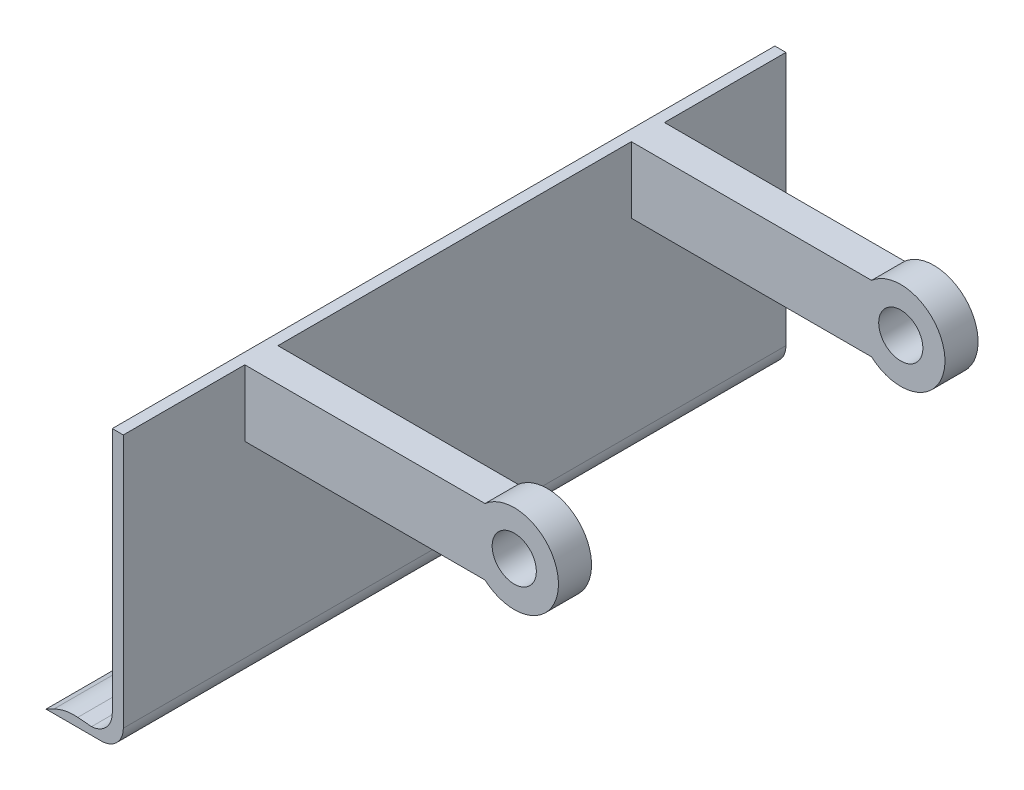
ISO-10303-21;
HEADER;
FILE_DESCRIPTION(('STEP AP214'),'2;1');
FILE_NAME('part.step','',(''),(''),'','','');
FILE_SCHEMA(('AUTOMOTIVE_DESIGN { 1 0 10303 214 1 1 1 1 }'));
ENDSEC;
DATA;
#1=APPLICATION_CONTEXT('core data for automotive mechanical design processes');
#2=APPLICATION_PROTOCOL_DEFINITION('international standard','automotive_design',2000,#1);
#3=PRODUCT_CONTEXT('',#1,'mechanical');
#4=PRODUCT('Part','Part','',(#3));
#5=PRODUCT_RELATED_PRODUCT_CATEGORY('part','',(#4));
#6=PRODUCT_DEFINITION_FORMATION('','',#4);
#7=PRODUCT_DEFINITION_CONTEXT('part definition',#1,'design');
#8=PRODUCT_DEFINITION('design','',#6,#7);
#9=PRODUCT_DEFINITION_SHAPE('','',#8);
#10=(LENGTH_UNIT() NAMED_UNIT(*) SI_UNIT(.MILLI.,.METRE.));
#11=(NAMED_UNIT(*) PLANE_ANGLE_UNIT() SI_UNIT($,.RADIAN.));
#12=(NAMED_UNIT(*) SI_UNIT($,.STERADIAN.) SOLID_ANGLE_UNIT());
#13=UNCERTAINTY_MEASURE_WITH_UNIT(LENGTH_MEASURE(1.E-05),#10,'distance_accuracy_value','');
#14=(GEOMETRIC_REPRESENTATION_CONTEXT(3) GLOBAL_UNCERTAINTY_ASSIGNED_CONTEXT((#13)) GLOBAL_UNIT_ASSIGNED_CONTEXT((#10,
#11,#12)) REPRESENTATION_CONTEXT('',''));
#15=CARTESIAN_POINT('',(0.,0.,0.));
#16=DIRECTION('',(0.,0.,1.));
#17=DIRECTION('',(1.,0.,0.));
#18=AXIS2_PLACEMENT_3D('',#15,#16,#17);
#19=CARTESIAN_POINT('',(0.,0.,300.));
#20=DIRECTION('',(-1.,0.,0.));
#21=DIRECTION('',(0.,0.,1.));
#22=AXIS2_PLACEMENT_3D('',#19,#20,#21);
#23=PLANE('',#22);
#24=DIRECTION('',(0.,-1.,0.));
#25=VECTOR('',#24,1.);
#26=CARTESIAN_POINT('',(0.,125.,70.));
#27=LINE('',#26,#25);
#28=CARTESIAN_POINT('',(0.,125.,70.));
#29=VERTEX_POINT('',#28);
#30=CARTESIAN_POINT('',(0.,95.,70.));
#31=VERTEX_POINT('',#30);
#32=EDGE_CURVE('E165',#29,#31,#27,.T.);
#33=ORIENTED_EDGE('',*,*,#32,.F.);
#34=DIRECTION('',(0.,0.,-1.));
#35=VECTOR('',#34,1.);
#36=CARTESIAN_POINT('',(0.,125.,300.));
#37=LINE('',#36,#35);
#38=CARTESIAN_POINT('',(0.,125.,230.));
#39=VERTEX_POINT('',#38);
#40=EDGE_CURVE('E248',#39,#29,#37,.T.);
#41=ORIENTED_EDGE('',*,*,#40,.F.);
#42=DIRECTION('',(0.,1.,0.));
#43=VECTOR('',#42,1.);
#44=CARTESIAN_POINT('',(0.,125.,230.));
#45=LINE('',#44,#43);
#46=CARTESIAN_POINT('',(0.,95.,230.));
#47=VERTEX_POINT('',#46);
#48=EDGE_CURVE('E161',#47,#39,#45,.T.);
#49=ORIENTED_EDGE('',*,*,#48,.F.);
#50=DIRECTION('',(0.,0.,-1.));
#51=VECTOR('',#50,1.);
#52=CARTESIAN_POINT('',(0.,95.,230.));
#53=LINE('',#52,#51);
#54=CARTESIAN_POINT('',(0.,95.,245.));
#55=VERTEX_POINT('',#54);
#56=EDGE_CURVE('E187',#55,#47,#53,.T.);
#57=ORIENTED_EDGE('',*,*,#56,.F.);
#58=DIRECTION('',(0.,-1.,0.));
#59=VECTOR('',#58,1.);
#60=CARTESIAN_POINT('',(0.,125.,245.));
#61=LINE('',#60,#59);
#62=CARTESIAN_POINT('',(0.,125.,245.));
#63=VERTEX_POINT('',#62);
#64=EDGE_CURVE('E184',#63,#55,#61,.T.);
#65=ORIENTED_EDGE('',*,*,#64,.F.);
#66=CARTESIAN_POINT('',(0.,125.,300.));
#67=VERTEX_POINT('',#66);
#68=EDGE_CURVE('E244',#67,#63,#37,.T.);
#69=ORIENTED_EDGE('',*,*,#68,.F.);
#70=DIRECTION('',(0.,1.,0.));
#71=VECTOR('',#70,1.);
#72=CARTESIAN_POINT('',(0.,0.,300.));
#73=LINE('',#72,#71);
#74=CARTESIAN_POINT('',(0.,10.0000000000001,300.));
#75=VERTEX_POINT('',#74);
#76=EDGE_CURVE('E216',#75,#67,#73,.T.);
#77=ORIENTED_EDGE('',*,*,#76,.F.);
#78=DIRECTION('',(0.,0.,-1.));
#79=VECTOR('',#78,1.);
#80=CARTESIAN_POINT('',(0.,10.0000000000001,300.));
#81=LINE('',#80,#79);
#82=CARTESIAN_POINT('',(0.,10.0000000000001,0.));
#83=VERTEX_POINT('',#82);
#84=EDGE_CURVE('E247',#75,#83,#81,.T.);
#85=ORIENTED_EDGE('',*,*,#84,.T.);
#86=DIRECTION('',(0.,1.,0.));
#87=VECTOR('',#86,1.);
#88=CARTESIAN_POINT('',(0.,0.,0.));
#89=LINE('',#88,#87);
#90=CARTESIAN_POINT('',(0.,125.,0.));
#91=VERTEX_POINT('',#90);
#92=EDGE_CURVE('E237',#83,#91,#89,.T.);
#93=ORIENTED_EDGE('',*,*,#92,.T.);
#94=CARTESIAN_POINT('',(0.,125.,55.));
#95=VERTEX_POINT('',#94);
#96=EDGE_CURVE('E243',#95,#91,#37,.T.);
#97=ORIENTED_EDGE('',*,*,#96,.F.);
#98=DIRECTION('',(0.,1.,0.));
#99=VECTOR('',#98,1.);
#100=CARTESIAN_POINT('',(0.,125.,55.));
#101=LINE('',#100,#99);
#102=CARTESIAN_POINT('',(0.,95.,55.));
#103=VERTEX_POINT('',#102);
#104=EDGE_CURVE('E173',#103,#95,#101,.T.);
#105=ORIENTED_EDGE('',*,*,#104,.F.);
#106=DIRECTION('',(0.,0.,-1.));
#107=VECTOR('',#106,1.);
#108=CARTESIAN_POINT('',(0.,95.,70.));
#109=LINE('',#108,#107);
#110=EDGE_CURVE('E156',#31,#103,#109,.T.);
#111=ORIENTED_EDGE('',*,*,#110,.F.);
#112=EDGE_LOOP('',(#33,#41,#49,#57,#65,#69,#77,#85,#93,#97,#105,#111));
#113=FACE_BOUND('',#112,.T.);
#114=ADVANCED_FACE('F35',(#113),#23,.F.);
#115=CARTESIAN_POINT('',(-5.,0.,300.));
#116=DIRECTION('',(1.,0.,0.));
#117=DIRECTION('',(0.,1.,0.));
#118=AXIS2_PLACEMENT_3D('',#115,#116,#117);
#119=PLANE('',#118);
#120=DIRECTION('',(0.,-1.,0.));
#121=VECTOR('',#120,1.);
#122=CARTESIAN_POINT('',(-5.,0.,0.));
#123=LINE('',#122,#121);
#124=CARTESIAN_POINT('',(-5.,125.,0.));
#125=VERTEX_POINT('',#124);
#126=CARTESIAN_POINT('',(-5.,13.4179912743919,0.));
#127=VERTEX_POINT('',#126);
#128=EDGE_CURVE('E198',#125,#127,#123,.T.);
#129=ORIENTED_EDGE('',*,*,#128,.T.);
#130=DIRECTION('',(0.,0.,-1.));
#131=VECTOR('',#130,1.);
#132=CARTESIAN_POINT('',(-5.,13.4179912743919,300.));
#133=LINE('',#132,#131);
#134=CARTESIAN_POINT('',(-5.,13.4179912743919,300.));
#135=VERTEX_POINT('',#134);
#136=EDGE_CURVE('E44',#135,#127,#133,.T.);
#137=ORIENTED_EDGE('',*,*,#136,.F.);
#138=DIRECTION('',(0.,-1.,0.));
#139=VECTOR('',#138,1.);
#140=CARTESIAN_POINT('',(-5.,0.,300.));
#141=LINE('',#140,#139);
#142=CARTESIAN_POINT('',(-5.,125.,300.));
#143=VERTEX_POINT('',#142);
#144=EDGE_CURVE('E199',#143,#135,#141,.T.);
#145=ORIENTED_EDGE('',*,*,#144,.F.);
#146=DIRECTION('',(0.,0.,-1.));
#147=VECTOR('',#146,1.);
#148=CARTESIAN_POINT('',(-5.,125.,300.));
#149=LINE('',#148,#147);
#150=EDGE_CURVE('E220',#143,#125,#149,.T.);
#151=ORIENTED_EDGE('',*,*,#150,.T.);
#152=EDGE_LOOP('',(#129,#137,#145,#151));
#153=FACE_BOUND('',#152,.T.);
#154=ADVANCED_FACE('F37',(#153),#119,.F.);
#155=CARTESIAN_POINT('',(-15.,13.4179912743919,300.));
#156=DIRECTION('',(0.,0.,-1.));
#157=DIRECTION('',(-1.,0.,0.));
#158=AXIS2_PLACEMENT_3D('',#155,#156,#157);
#159=CYLINDRICAL_SURFACE('',#158,10.);
#160=CARTESIAN_POINT('',(-15.,13.4179912743919,0.));
#161=DIRECTION('',(0.,0.,1.));
#162=DIRECTION('',(1.,0.,0.));
#163=AXIS2_PLACEMENT_3D('',#160,#161,#162);
#164=CIRCLE('',#163,10.);
#165=CARTESIAN_POINT('',(-14.3870107387115,3.43679674840729,0.));
#166=VERTEX_POINT('',#165);
#167=EDGE_CURVE('E223',#127,#166,#164,.F.);
#168=ORIENTED_EDGE('',*,*,#167,.T.);
#169=DIRECTION('',(0.,0.,-1.));
#170=VECTOR('',#169,1.);
#171=CARTESIAN_POINT('',(-14.3870107387115,3.43679674840729,300.));
#172=LINE('',#171,#170);
#173=CARTESIAN_POINT('',(-14.3870107387115,3.43679674840729,300.));
#174=VERTEX_POINT('',#173);
#175=EDGE_CURVE('E261',#174,#166,#172,.T.);
#176=ORIENTED_EDGE('',*,*,#175,.F.);
#177=CARTESIAN_POINT('',(-15.,13.4179912743919,300.));
#178=DIRECTION('',(0.,0.,1.));
#179=DIRECTION('',(1.,0.,0.));
#180=AXIS2_PLACEMENT_3D('',#177,#178,#179);
#181=CIRCLE('',#180,10.);
#182=EDGE_CURVE('E202',#135,#174,#181,.F.);
#183=ORIENTED_EDGE('',*,*,#182,.F.);
#184=ORIENTED_EDGE('',*,*,#136,.T.);
#185=EDGE_LOOP('',(#168,#176,#183,#184));
#186=FACE_BOUND('',#185,.T.);
#187=ADVANCED_FACE('F267',(#186),#159,.F.);
#188=CARTESIAN_POINT('',(0.186203973970404,2.20758390080925,300.));
#189=DIRECTION('',(-0.0840489526757902,-0.996461626734368,0.));
#190=DIRECTION('',(0.996461626734368,-0.0840489526757902,0.));
#191=AXIS2_PLACEMENT_3D('',#188,#189,#190);
#192=PLANE('',#191);
#193=DIRECTION('',(-0.996461626734368,0.0840489526757902,0.));
#194=VECTOR('',#193,1.);
#195=CARTESIAN_POINT('',(0.186203973970404,2.20758390080925,0.));
#196=LINE('',#195,#194);
#197=CARTESIAN_POINT('',(-20.619947117888,3.96252875926402,0.));
#198=VERTEX_POINT('',#197);
#199=EDGE_CURVE('E225',#166,#198,#196,.T.);
#200=ORIENTED_EDGE('',*,*,#199,.T.);
#201=DIRECTION('',(0.,0.,-1.));
#202=VECTOR('',#201,1.);
#203=CARTESIAN_POINT('',(-20.619947117888,3.96252875926402,300.));
#204=LINE('',#203,#202);
#205=CARTESIAN_POINT('',(-20.619947117888,3.96252875926402,300.));
#206=VERTEX_POINT('',#205);
#207=EDGE_CURVE('E259',#206,#198,#204,.T.);
#208=ORIENTED_EDGE('',*,*,#207,.F.);
#209=DIRECTION('',(-0.996461626734368,0.0840489526757902,0.));
#210=VECTOR('',#209,1.);
#211=CARTESIAN_POINT('',(0.186203973970404,2.20758390080925,300.));
#212=LINE('',#211,#210);
#213=EDGE_CURVE('E205',#174,#206,#212,.T.);
#214=ORIENTED_EDGE('',*,*,#213,.F.);
#215=ORIENTED_EDGE('',*,*,#175,.T.);
#216=EDGE_LOOP('',(#200,#208,#214,#215));
#217=FACE_BOUND('',#216,.T.);
#218=ADVANCED_FACE('F282',(#217),#192,.F.);
#219=CARTESIAN_POINT('',(-22.3009261714039,-15.9667037754233,300.));
#220=DIRECTION('',(0.,0.,-1.));
#221=DIRECTION('',(-1.,0.,0.));
#222=AXIS2_PLACEMENT_3D('',#219,#220,#221);
#223=CYLINDRICAL_SURFACE('',#222,20.);
#224=CARTESIAN_POINT('',(-22.3009261714039,-15.9667037754233,0.));
#225=DIRECTION('',(0.,0.,1.));
#226=DIRECTION('',(1.,0.,0.));
#227=AXIS2_PLACEMENT_3D('',#224,#225,#226);
#228=CIRCLE('',#227,20.);
#229=CARTESIAN_POINT('',(-31.4172931870261,1.83475269410396,0.));
#230=VERTEX_POINT('',#229);
#231=EDGE_CURVE('E228',#230,#198,#228,.F.);
#232=ORIENTED_EDGE('',*,*,#231,.F.);
#233=DIRECTION('',(0.,0.,-1.));
#234=VECTOR('',#233,1.);
#235=CARTESIAN_POINT('',(-31.4172931870261,1.83475269410396,300.));
#236=LINE('',#235,#234);
#237=CARTESIAN_POINT('',(-31.4172931870261,1.83475269410396,300.));
#238=VERTEX_POINT('',#237);
#239=EDGE_CURVE('E257',#238,#230,#236,.T.);
#240=ORIENTED_EDGE('',*,*,#239,.F.);
#241=CARTESIAN_POINT('',(-22.3009261714039,-15.9667037754233,300.));
#242=DIRECTION('',(0.,0.,1.));
#243=DIRECTION('',(1.,0.,0.));
#244=AXIS2_PLACEMENT_3D('',#241,#242,#243);
#245=CIRCLE('',#244,20.);
#246=EDGE_CURVE('E207',#238,#206,#245,.F.);
#247=ORIENTED_EDGE('',*,*,#246,.T.);
#248=ORIENTED_EDGE('',*,*,#207,.T.);
#249=EDGE_LOOP('',(#232,#240,#247,#248));
#250=FACE_BOUND('',#249,.T.);
#251=ADVANCED_FACE('F307',(#250),#223,.T.);
#252=CARTESIAN_POINT('',(-7.27196291180832,14.1999034265229,300.));
#253=DIRECTION('',(0.455818350781108,-0.890072823476366,0.));
#254=DIRECTION('',(0.890072823476366,0.455818350781108,0.));
#255=AXIS2_PLACEMENT_3D('',#252,#253,#254);
#256=PLANE('',#255);
#257=DIRECTION('',(-0.890072823476367,-0.455818350781108,0.));
#258=VECTOR('',#257,1.);
#259=CARTESIAN_POINT('',(-7.27196291180832,14.1999034265229,0.));
#260=LINE('',#259,#258);
#261=CARTESIAN_POINT('',(-35.,0.,0.));
#262=VERTEX_POINT('',#261);
#263=EDGE_CURVE('E231',#230,#262,#260,.T.);
#264=ORIENTED_EDGE('',*,*,#263,.T.);
#265=DIRECTION('',(0.,0.,-1.));
#266=VECTOR('',#265,1.);
#267=CARTESIAN_POINT('',(-35.,0.,300.));
#268=LINE('',#267,#266);
#269=CARTESIAN_POINT('',(-35.,0.,300.));
#270=VERTEX_POINT('',#269);
#271=EDGE_CURVE('E254',#270,#262,#268,.T.);
#272=ORIENTED_EDGE('',*,*,#271,.F.);
#273=DIRECTION('',(-0.890072823476367,-0.455818350781108,0.));
#274=VECTOR('',#273,1.);
#275=CARTESIAN_POINT('',(-7.27196291180832,14.1999034265229,300.));
#276=LINE('',#275,#274);
#277=EDGE_CURVE('E210',#238,#270,#276,.T.);
#278=ORIENTED_EDGE('',*,*,#277,.F.);
#279=ORIENTED_EDGE('',*,*,#239,.T.);
#280=EDGE_LOOP('',(#264,#272,#278,#279));
#281=FACE_BOUND('',#280,.T.);
#282=ADVANCED_FACE('F305',(#281),#256,.F.);
#283=CARTESIAN_POINT('',(0.,0.,300.));
#284=DIRECTION('',(0.,1.,0.));
#285=DIRECTION('',(0.,0.,1.));
#286=AXIS2_PLACEMENT_3D('',#283,#284,#285);
#287=PLANE('',#286);
#288=DIRECTION('',(1.,0.,0.));
#289=VECTOR('',#288,1.);
#290=CARTESIAN_POINT('',(0.,0.,0.));
#291=LINE('',#290,#289);
#292=CARTESIAN_POINT('',(-10.0000000000001,0.,0.));
#293=VERTEX_POINT('',#292);
#294=EDGE_CURVE('E233',#262,#293,#291,.T.);
#295=ORIENTED_EDGE('',*,*,#294,.T.);
#296=DIRECTION('',(0.,0.,-1.));
#297=VECTOR('',#296,1.);
#298=CARTESIAN_POINT('',(-10.0000000000001,0.,300.));
#299=LINE('',#298,#297);
#300=CARTESIAN_POINT('',(-10.0000000000001,0.,300.));
#301=VERTEX_POINT('',#300);
#302=EDGE_CURVE('E251',#301,#293,#299,.T.);
#303=ORIENTED_EDGE('',*,*,#302,.F.);
#304=DIRECTION('',(1.,0.,0.));
#305=VECTOR('',#304,1.);
#306=CARTESIAN_POINT('',(0.,0.,300.));
#307=LINE('',#306,#305);
#308=EDGE_CURVE('E212',#270,#301,#307,.T.);
#309=ORIENTED_EDGE('',*,*,#308,.F.);
#310=ORIENTED_EDGE('',*,*,#271,.T.);
#311=EDGE_LOOP('',(#295,#303,#309,#310));
#312=FACE_BOUND('',#311,.T.);
#313=ADVANCED_FACE('F301',(#312),#287,.F.);
#314=CARTESIAN_POINT('',(-10.,10.,300.));
#315=DIRECTION('',(0.,0.,-1.));
#316=DIRECTION('',(-1.,0.,0.));
#317=AXIS2_PLACEMENT_3D('',#314,#315,#316);
#318=CYLINDRICAL_SURFACE('',#317,10.);
#319=CARTESIAN_POINT('',(-10.,10.,0.));
#320=DIRECTION('',(0.,0.,1.));
#321=DIRECTION('',(1.,0.,0.));
#322=AXIS2_PLACEMENT_3D('',#319,#320,#321);
#323=CIRCLE('',#322,10.);
#324=EDGE_CURVE('E235',#293,#83,#323,.T.);
#325=ORIENTED_EDGE('',*,*,#324,.T.);
#326=ORIENTED_EDGE('',*,*,#84,.F.);
#327=CARTESIAN_POINT('',(-10.,10.,300.));
#328=DIRECTION('',(0.,0.,1.));
#329=DIRECTION('',(1.,0.,0.));
#330=AXIS2_PLACEMENT_3D('',#327,#328,#329);
#331=CIRCLE('',#330,10.);
#332=EDGE_CURVE('E214',#301,#75,#331,.T.);
#333=ORIENTED_EDGE('',*,*,#332,.F.);
#334=ORIENTED_EDGE('',*,*,#302,.T.);
#335=EDGE_LOOP('',(#325,#326,#333,#334));
#336=FACE_BOUND('',#335,.T.);
#337=ADVANCED_FACE('F296',(#336),#318,.T.);
#338=CARTESIAN_POINT('',(0.,125.,300.));
#339=DIRECTION('',(0.,-1.,0.));
#340=DIRECTION('',(0.,0.,-1.));
#341=AXIS2_PLACEMENT_3D('',#338,#339,#340);
#342=PLANE('',#341);
#343=DIRECTION('',(-1.,0.,0.));
#344=VECTOR('',#343,1.);
#345=CARTESIAN_POINT('',(115.,125.,70.));
#346=LINE('',#345,#344);
#347=CARTESIAN_POINT('',(108.771243444677,125.,70.));
#348=VERTEX_POINT('',#347);
#349=EDGE_CURVE('E51',#348,#29,#346,.T.);
#350=ORIENTED_EDGE('',*,*,#349,.F.);
#351=DIRECTION('',(0.,0.,1.));
#352=VECTOR('',#351,1.);
#353=CARTESIAN_POINT('',(108.771243444677,125.,-1.56854249492383));
#354=LINE('',#353,#352);
#355=CARTESIAN_POINT('',(108.771243444677,125.,55.));
#356=VERTEX_POINT('',#355);
#357=EDGE_CURVE('E533',#348,#356,#354,.F.);
#358=ORIENTED_EDGE('',*,*,#357,.T.);
#359=DIRECTION('',(-1.,0.,0.));
#360=VECTOR('',#359,1.);
#361=CARTESIAN_POINT('',(115.,125.,55.));
#362=LINE('',#361,#360);
#363=EDGE_CURVE('E179',#356,#95,#362,.T.);
#364=ORIENTED_EDGE('',*,*,#363,.T.);
#365=ORIENTED_EDGE('',*,*,#96,.T.);
#366=DIRECTION('',(-1.,0.,0.));
#367=VECTOR('',#366,1.);
#368=CARTESIAN_POINT('',(0.,125.,0.));
#369=LINE('',#368,#367);
#370=EDGE_CURVE('E203',#91,#125,#369,.T.);
#371=ORIENTED_EDGE('',*,*,#370,.T.);
#372=ORIENTED_EDGE('',*,*,#150,.F.);
#373=DIRECTION('',(-1.,0.,0.));
#374=VECTOR('',#373,1.);
#375=CARTESIAN_POINT('',(0.,125.,300.));
#376=LINE('',#375,#374);
#377=EDGE_CURVE('E218',#67,#143,#376,.T.);
#378=ORIENTED_EDGE('',*,*,#377,.F.);
#379=ORIENTED_EDGE('',*,*,#68,.T.);
#380=DIRECTION('',(-1.,0.,0.));
#381=VECTOR('',#380,1.);
#382=CARTESIAN_POINT('',(115.,125.,245.));
#383=LINE('',#382,#381);
#384=CARTESIAN_POINT('',(108.771243444677,125.,245.));
#385=VERTEX_POINT('',#384);
#386=EDGE_CURVE('E194',#385,#63,#383,.T.);
#387=ORIENTED_EDGE('',*,*,#386,.F.);
#388=DIRECTION('',(0.,0.,1.));
#389=VECTOR('',#388,1.);
#390=CARTESIAN_POINT('',(108.771243444677,125.,173.431457505076));
#391=LINE('',#390,#389);
#392=CARTESIAN_POINT('',(108.771243444677,125.,230.));
#393=VERTEX_POINT('',#392);
#394=EDGE_CURVE('E169',#385,#393,#391,.F.);
#395=ORIENTED_EDGE('',*,*,#394,.T.);
#396=DIRECTION('',(-1.,0.,0.));
#397=VECTOR('',#396,1.);
#398=CARTESIAN_POINT('',(115.,125.,230.));
#399=LINE('',#398,#397);
#400=EDGE_CURVE('E196',#393,#39,#399,.T.);
#401=ORIENTED_EDGE('',*,*,#400,.T.);
#402=ORIENTED_EDGE('',*,*,#40,.T.);
#403=EDGE_LOOP('',(#350,#358,#364,#365,#371,#372,#378,#379,#387,#395,#401,#402));
#404=FACE_BOUND('',#403,.T.);
#405=ADVANCED_FACE('F290',(#404),#342,.F.);
#406=CARTESIAN_POINT('',(0.,0.,300.));
#407=DIRECTION('',(0.,0.,1.));
#408=DIRECTION('',(1.,0.,0.));
#409=AXIS2_PLACEMENT_3D('',#406,#407,#408);
#410=PLANE('',#409);
#411=ORIENTED_EDGE('',*,*,#144,.T.);
#412=ORIENTED_EDGE('',*,*,#182,.T.);
#413=ORIENTED_EDGE('',*,*,#213,.T.);
#414=ORIENTED_EDGE('',*,*,#246,.F.);
#415=ORIENTED_EDGE('',*,*,#277,.T.);
#416=ORIENTED_EDGE('',*,*,#308,.T.);
#417=ORIENTED_EDGE('',*,*,#332,.T.);
#418=ORIENTED_EDGE('',*,*,#76,.T.);
#419=ORIENTED_EDGE('',*,*,#377,.T.);
#420=EDGE_LOOP('',(#411,#412,#413,#414,#415,#416,#417,#418,#419));
#421=FACE_BOUND('',#420,.T.);
#422=ADVANCED_FACE('F286',(#421),#410,.T.);
#423=CARTESIAN_POINT('',(0.,0.,0.));
#424=DIRECTION('',(0.,0.,1.));
#425=DIRECTION('',(1.,0.,0.));
#426=AXIS2_PLACEMENT_3D('',#423,#424,#425);
#427=PLANE('',#426);
#428=ORIENTED_EDGE('',*,*,#128,.F.);
#429=ORIENTED_EDGE('',*,*,#370,.F.);
#430=ORIENTED_EDGE('',*,*,#92,.F.);
#431=ORIENTED_EDGE('',*,*,#324,.F.);
#432=ORIENTED_EDGE('',*,*,#294,.F.);
#433=ORIENTED_EDGE('',*,*,#263,.F.);
#434=ORIENTED_EDGE('',*,*,#231,.T.);
#435=ORIENTED_EDGE('',*,*,#199,.F.);
#436=ORIENTED_EDGE('',*,*,#167,.F.);
#437=EDGE_LOOP('',(#428,#429,#430,#431,#432,#433,#434,#435,#436));
#438=FACE_BOUND('',#437,.T.);
#439=ADVANCED_FACE('F275',(#438),#427,.F.);
#440=CARTESIAN_POINT('',(115.,125.,230.));
#441=DIRECTION('',(0.,0.,1.));
#442=DIRECTION('',(1.,0.,0.));
#443=AXIS2_PLACEMENT_3D('',#440,#441,#442);
#444=PLANE('',#443);
#445=CARTESIAN_POINT('',(122.,110.,230.));
#446=DIRECTION('',(0.,0.,1.));
#447=DIRECTION('',(1.,0.,0.));
#448=AXIS2_PLACEMENT_3D('',#445,#446,#447);
#449=CIRCLE('',#448,10.);
#450=CARTESIAN_POINT('',(132.,110.,230.));
#451=VERTEX_POINT('',#450);
#452=EDGE_CURVE('E520',#451,#451,#449,.T.);
#453=ORIENTED_EDGE('',*,*,#452,.T.);
#454=EDGE_LOOP('',(#453));
#455=FACE_BOUND('',#454,.T.);
#456=ORIENTED_EDGE('',*,*,#400,.F.);
#457=CARTESIAN_POINT('',(122.,110.,230.));
#458=DIRECTION('',(0.,0.,1.));
#459=DIRECTION('',(1.,0.,0.));
#460=AXIS2_PLACEMENT_3D('',#457,#458,#459);
#461=CIRCLE('',#460,20.);
#462=CARTESIAN_POINT('',(108.771243444677,95.,230.));
#463=VERTEX_POINT('',#462);
#464=EDGE_CURVE('E538',#393,#463,#461,.F.);
#465=ORIENTED_EDGE('',*,*,#464,.T.);
#466=DIRECTION('',(-1.,0.,0.));
#467=VECTOR('',#466,1.);
#468=CARTESIAN_POINT('',(115.,95.,230.));
#469=LINE('',#468,#467);
#470=EDGE_CURVE('E190',#463,#47,#469,.T.);
#471=ORIENTED_EDGE('',*,*,#470,.T.);
#472=ORIENTED_EDGE('',*,*,#48,.T.);
#473=EDGE_LOOP('',(#456,#465,#471,#472));
#474=FACE_BOUND('',#473,.T.);
#475=ADVANCED_FACE('F354',(#455,#474),#444,.F.);
#476=CARTESIAN_POINT('',(115.,125.,245.));
#477=DIRECTION('',(0.,0.,-1.));
#478=DIRECTION('',(0.,1.,0.));
#479=AXIS2_PLACEMENT_3D('',#476,#477,#478);
#480=PLANE('',#479);
#481=CARTESIAN_POINT('',(122.,110.,245.));
#482=DIRECTION('',(0.,0.,1.));
#483=DIRECTION('',(1.,0.,0.));
#484=AXIS2_PLACEMENT_3D('',#481,#482,#483);
#485=CIRCLE('',#484,10.);
#486=CARTESIAN_POINT('',(132.,110.,245.));
#487=VERTEX_POINT('',#486);
#488=EDGE_CURVE('E517',#487,#487,#485,.T.);
#489=ORIENTED_EDGE('',*,*,#488,.F.);
#490=EDGE_LOOP('',(#489));
#491=FACE_BOUND('',#490,.T.);
#492=CARTESIAN_POINT('',(122.,110.,245.));
#493=DIRECTION('',(0.,0.,1.));
#494=DIRECTION('',(1.,0.,0.));
#495=AXIS2_PLACEMENT_3D('',#492,#493,#494);
#496=CIRCLE('',#495,20.);
#497=CARTESIAN_POINT('',(108.771243444677,95.,245.));
#498=VERTEX_POINT('',#497);
#499=EDGE_CURVE('E535',#498,#385,#496,.T.);
#500=ORIENTED_EDGE('',*,*,#499,.T.);
#501=ORIENTED_EDGE('',*,*,#386,.T.);
#502=ORIENTED_EDGE('',*,*,#64,.T.);
#503=DIRECTION('',(-1.,0.,0.));
#504=VECTOR('',#503,1.);
#505=CARTESIAN_POINT('',(115.,95.,245.));
#506=LINE('',#505,#504);
#507=EDGE_CURVE('E192',#498,#55,#506,.T.);
#508=ORIENTED_EDGE('',*,*,#507,.F.);
#509=EDGE_LOOP('',(#500,#501,#502,#508));
#510=FACE_BOUND('',#509,.T.);
#511=ADVANCED_FACE('F360',(#491,#510),#480,.F.);
#512=CARTESIAN_POINT('',(115.,95.,230.));
#513=DIRECTION('',(0.,1.,0.));
#514=DIRECTION('',(0.,0.,1.));
#515=AXIS2_PLACEMENT_3D('',#512,#513,#514);
#516=PLANE('',#515);
#517=ORIENTED_EDGE('',*,*,#470,.F.);
#518=DIRECTION('',(0.,0.,1.));
#519=VECTOR('',#518,1.);
#520=CARTESIAN_POINT('',(108.771243444677,95.,173.431457505076));
#521=LINE('',#520,#519);
#522=EDGE_CURVE('E11',#463,#498,#521,.T.);
#523=ORIENTED_EDGE('',*,*,#522,.T.);
#524=ORIENTED_EDGE('',*,*,#507,.T.);
#525=ORIENTED_EDGE('',*,*,#56,.T.);
#526=EDGE_LOOP('',(#517,#523,#524,#525));
#527=FACE_BOUND('',#526,.T.);
#528=ADVANCED_FACE('F369',(#527),#516,.F.);
#529=CARTESIAN_POINT('',(115.,125.,70.));
#530=DIRECTION('',(0.,0.,-1.));
#531=DIRECTION('',(-1.,0.,0.));
#532=AXIS2_PLACEMENT_3D('',#529,#530,#531);
#533=PLANE('',#532);
#534=CARTESIAN_POINT('',(122.,110.,70.));
#535=DIRECTION('',(0.,0.,-1.));
#536=DIRECTION('',(-1.,0.,0.));
#537=AXIS2_PLACEMENT_3D('',#534,#535,#536);
#538=CIRCLE('',#537,10.);
#539=CARTESIAN_POINT('',(112.,110.,70.));
#540=VERTEX_POINT('',#539);
#541=EDGE_CURVE('E522',#540,#540,#538,.T.);
#542=ORIENTED_EDGE('',*,*,#541,.T.);
#543=EDGE_LOOP('',(#542));
#544=FACE_BOUND('',#543,.T.);
#545=CARTESIAN_POINT('',(122.,110.,70.));
#546=DIRECTION('',(0.,0.,1.));
#547=DIRECTION('',(1.,0.,0.));
#548=AXIS2_PLACEMENT_3D('',#545,#546,#547);
#549=CIRCLE('',#548,20.);
#550=CARTESIAN_POINT('',(108.771243444677,95.,70.));
#551=VERTEX_POINT('',#550);
#552=EDGE_CURVE('E521',#551,#348,#549,.T.);
#553=ORIENTED_EDGE('',*,*,#552,.T.);
#554=ORIENTED_EDGE('',*,*,#349,.T.);
#555=ORIENTED_EDGE('',*,*,#32,.T.);
#556=DIRECTION('',(-1.,0.,0.));
#557=VECTOR('',#556,1.);
#558=CARTESIAN_POINT('',(115.,95.,70.));
#559=LINE('',#558,#557);
#560=EDGE_CURVE('E152',#551,#31,#559,.T.);
#561=ORIENTED_EDGE('',*,*,#560,.F.);
#562=EDGE_LOOP('',(#553,#554,#555,#561));
#563=FACE_BOUND('',#562,.T.);
#564=ADVANCED_FACE('F166',(#544,#563),#533,.F.);
#565=CARTESIAN_POINT('',(115.,95.,70.));
#566=DIRECTION('',(0.,1.,0.));
#567=DIRECTION('',(0.,0.,1.));
#568=AXIS2_PLACEMENT_3D('',#565,#566,#567);
#569=PLANE('',#568);
#570=DIRECTION('',(-1.,0.,0.));
#571=VECTOR('',#570,1.);
#572=CARTESIAN_POINT('',(115.,95.,55.));
#573=LINE('',#572,#571);
#574=CARTESIAN_POINT('',(108.771243444677,95.,55.));
#575=VERTEX_POINT('',#574);
#576=EDGE_CURVE('E162',#575,#103,#573,.T.);
#577=ORIENTED_EDGE('',*,*,#576,.F.);
#578=DIRECTION('',(0.,0.,1.));
#579=VECTOR('',#578,1.);
#580=CARTESIAN_POINT('',(108.771243444677,95.,-1.56854249492383));
#581=LINE('',#580,#579);
#582=EDGE_CURVE('E59',#575,#551,#581,.T.);
#583=ORIENTED_EDGE('',*,*,#582,.T.);
#584=ORIENTED_EDGE('',*,*,#560,.T.);
#585=ORIENTED_EDGE('',*,*,#110,.T.);
#586=EDGE_LOOP('',(#577,#583,#584,#585));
#587=FACE_BOUND('',#586,.T.);
#588=ADVANCED_FACE('F154',(#587),#569,.F.);
#589=CARTESIAN_POINT('',(115.,125.,55.));
#590=DIRECTION('',(0.,0.,1.));
#591=DIRECTION('',(0.,-1.,0.));
#592=AXIS2_PLACEMENT_3D('',#589,#590,#591);
#593=PLANE('',#592);
#594=CARTESIAN_POINT('',(122.,110.,55.));
#595=DIRECTION('',(0.,0.,1.));
#596=DIRECTION('',(0.,-1.,0.));
#597=AXIS2_PLACEMENT_3D('',#594,#595,#596);
#598=CIRCLE('',#597,10.);
#599=CARTESIAN_POINT('',(122.,99.9999999999997,55.));
#600=VERTEX_POINT('',#599);
#601=EDGE_CURVE('E39',#600,#600,#598,.T.);
#602=ORIENTED_EDGE('',*,*,#601,.T.);
#603=EDGE_LOOP('',(#602));
#604=FACE_BOUND('',#603,.T.);
#605=ORIENTED_EDGE('',*,*,#363,.F.);
#606=CARTESIAN_POINT('',(122.,110.,55.));
#607=DIRECTION('',(0.,0.,1.));
#608=DIRECTION('',(0.,-1.,0.));
#609=AXIS2_PLACEMENT_3D('',#606,#607,#608);
#610=CIRCLE('',#609,20.);
#611=EDGE_CURVE('E524',#356,#575,#610,.F.);
#612=ORIENTED_EDGE('',*,*,#611,.T.);
#613=ORIENTED_EDGE('',*,*,#576,.T.);
#614=ORIENTED_EDGE('',*,*,#104,.T.);
#615=EDGE_LOOP('',(#605,#612,#613,#614));
#616=FACE_BOUND('',#615,.T.);
#617=ADVANCED_FACE('F391',(#604,#616),#593,.F.);
#618=CARTESIAN_POINT('',(122.,110.,173.431457505076));
#619=DIRECTION('',(0.,0.,1.));
#620=DIRECTION('',(1.,0.,0.));
#621=AXIS2_PLACEMENT_3D('',#618,#619,#620);
#622=CYLINDRICAL_SURFACE('',#621,20.);
#623=ORIENTED_EDGE('',*,*,#394,.F.);
#624=ORIENTED_EDGE('',*,*,#499,.F.);
#625=ORIENTED_EDGE('',*,*,#522,.F.);
#626=ORIENTED_EDGE('',*,*,#464,.F.);
#627=EDGE_LOOP('',(#623,#624,#625,#626));
#628=FACE_BOUND('',#627,.T.);
#629=ADVANCED_FACE('F397',(#628),#622,.T.);
#630=CARTESIAN_POINT('',(122.,110.,-1.56854249492383));
#631=DIRECTION('',(0.,0.,1.));
#632=DIRECTION('',(1.,0.,0.));
#633=AXIS2_PLACEMENT_3D('',#630,#631,#632);
#634=CYLINDRICAL_SURFACE('',#633,20.);
#635=ORIENTED_EDGE('',*,*,#357,.F.);
#636=ORIENTED_EDGE('',*,*,#552,.F.);
#637=ORIENTED_EDGE('',*,*,#582,.F.);
#638=ORIENTED_EDGE('',*,*,#611,.F.);
#639=EDGE_LOOP('',(#635,#636,#637,#638));
#640=FACE_BOUND('',#639,.T.);
#641=ADVANCED_FACE('F405',(#640),#634,.T.);
#642=CARTESIAN_POINT('',(122.,110.,0.));
#643=DIRECTION('',(0.,0.,1.));
#644=DIRECTION('',(1.,0.,0.));
#645=AXIS2_PLACEMENT_3D('',#642,#643,#644);
#646=CYLINDRICAL_SURFACE('',#645,10.);
#647=ORIENTED_EDGE('',*,*,#601,.F.);
#648=EDGE_LOOP('',(#647));
#649=FACE_BOUND('',#648,.T.);
#650=ORIENTED_EDGE('',*,*,#541,.F.);
#651=EDGE_LOOP('',(#650));
#652=FACE_BOUND('',#651,.T.);
#653=ADVANCED_FACE('F412',(#649,#652),#646,.F.);
#654=ORIENTED_EDGE('',*,*,#488,.T.);
#655=EDGE_LOOP('',(#654));
#656=FACE_BOUND('',#655,.T.);
#657=ORIENTED_EDGE('',*,*,#452,.F.);
#658=EDGE_LOOP('',(#657));
#659=FACE_BOUND('',#658,.T.);
#660=ADVANCED_FACE('F419',(#656,#659),#646,.F.);
#661=CLOSED_SHELL('',(#114,#154,#187,#218,#251,#282,#313,#337,#405,#422,#439,#475,#511,#528,
#564,#588,#617,#629,#641,#653,#660));
#662=MANIFOLD_SOLID_BREP('B2',#661);
#663=ADVANCED_BREP_SHAPE_REPRESENTATION('',(#18,#662),#14);
#664=SHAPE_DEFINITION_REPRESENTATION(#9,#663);
ENDSEC;
END-ISO-10303-21;
